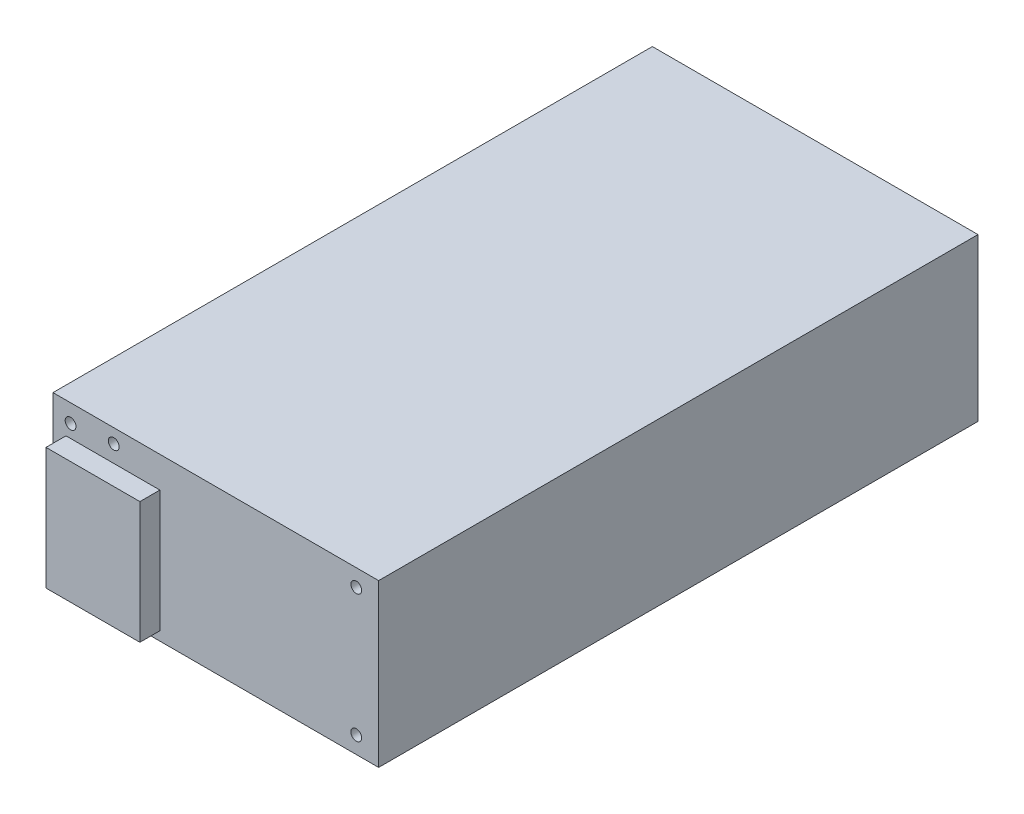
ISO-10303-21;
HEADER;
FILE_DESCRIPTION(('STEP AP214'),'2;1');
FILE_NAME('part.step','',(''),(''),'','','');
FILE_SCHEMA(('AUTOMOTIVE_DESIGN { 1 0 10303 214 1 1 1 1 }'));
ENDSEC;
DATA;
#1=APPLICATION_CONTEXT('core data for automotive mechanical design processes');
#2=APPLICATION_PROTOCOL_DEFINITION('international standard','automotive_design',2000,#1);
#3=PRODUCT_CONTEXT('',#1,'mechanical');
#4=PRODUCT('Part','Part','',(#3));
#5=PRODUCT_RELATED_PRODUCT_CATEGORY('part','',(#4));
#6=PRODUCT_DEFINITION_FORMATION('','',#4);
#7=PRODUCT_DEFINITION_CONTEXT('part definition',#1,'design');
#8=PRODUCT_DEFINITION('design','',#6,#7);
#9=PRODUCT_DEFINITION_SHAPE('','',#8);
#10=(LENGTH_UNIT() NAMED_UNIT(*) SI_UNIT(.MILLI.,.METRE.));
#11=(NAMED_UNIT(*) PLANE_ANGLE_UNIT() SI_UNIT($,.RADIAN.));
#12=(NAMED_UNIT(*) SI_UNIT($,.STERADIAN.) SOLID_ANGLE_UNIT());
#13=UNCERTAINTY_MEASURE_WITH_UNIT(LENGTH_MEASURE(1.E-05),#10,'distance_accuracy_value','');
#14=(GEOMETRIC_REPRESENTATION_CONTEXT(3) GLOBAL_UNCERTAINTY_ASSIGNED_CONTEXT((#13)) GLOBAL_UNIT_ASSIGNED_CONTEXT((#10,
#11,#12)) REPRESENTATION_CONTEXT('',''));
#15=CARTESIAN_POINT('',(0.,0.,0.));
#16=DIRECTION('',(0.,0.,1.));
#17=DIRECTION('',(1.,0.,0.));
#18=AXIS2_PLACEMENT_3D('',#15,#16,#17);
#19=CARTESIAN_POINT('',(81.5,0.,0.));
#20=DIRECTION('',(0.,0.,-1.));
#21=DIRECTION('',(-1.,0.,0.));
#22=AXIS2_PLACEMENT_3D('',#19,#20,#21);
#23=PLANE('',#22);
#24=DIRECTION('',(0.,-1.,0.));
#25=VECTOR('',#24,1.);
#26=CARTESIAN_POINT('',(0.,0.,0.));
#27=LINE('',#26,#25);
#28=CARTESIAN_POINT('',(0.,40.5,0.));
#29=VERTEX_POINT('',#28);
#30=CARTESIAN_POINT('',(0.,0.,0.));
#31=VERTEX_POINT('',#30);
#32=EDGE_CURVE('E171',#29,#31,#27,.T.);
#33=ORIENTED_EDGE('',*,*,#32,.T.);
#34=DIRECTION('',(-1.,0.,0.));
#35=VECTOR('',#34,1.);
#36=CARTESIAN_POINT('',(81.5,0.,0.));
#37=LINE('',#36,#35);
#38=CARTESIAN_POINT('',(81.5,0.,0.));
#39=VERTEX_POINT('',#38);
#40=EDGE_CURVE('E177',#39,#31,#37,.T.);
#41=ORIENTED_EDGE('',*,*,#40,.F.);
#42=DIRECTION('',(0.,-1.,0.));
#43=VECTOR('',#42,1.);
#44=CARTESIAN_POINT('',(81.5,0.,0.));
#45=LINE('',#44,#43);
#46=CARTESIAN_POINT('',(81.5,40.5,0.));
#47=VERTEX_POINT('',#46);
#48=EDGE_CURVE('E175',#47,#39,#45,.T.);
#49=ORIENTED_EDGE('',*,*,#48,.F.);
#50=DIRECTION('',(-1.,0.,0.));
#51=VECTOR('',#50,1.);
#52=CARTESIAN_POINT('',(81.5,40.5,0.));
#53=LINE('',#52,#51);
#54=EDGE_CURVE('E187',#47,#29,#53,.T.);
#55=ORIENTED_EDGE('',*,*,#54,.T.);
#56=EDGE_LOOP('',(#33,#41,#49,#55));
#57=FACE_BOUND('',#56,.T.);
#58=CARTESIAN_POINT('',(75.9,4.25,0.));
#59=DIRECTION('',(0.,0.,1.));
#60=DIRECTION('',(1.,0.,0.));
#61=AXIS2_PLACEMENT_3D('',#58,#59,#60);
#62=CIRCLE('',#61,1.35254999999999);
#63=CARTESIAN_POINT('',(77.25255,4.25,0.));
#64=VERTEX_POINT('',#63);
#65=EDGE_CURVE('E160',#64,#64,#62,.T.);
#66=ORIENTED_EDGE('',*,*,#65,.F.);
#67=EDGE_LOOP('',(#66));
#68=FACE_BOUND('',#67,.T.);
#69=CARTESIAN_POINT('',(75.9,36.25,0.));
#70=DIRECTION('',(0.,0.,1.));
#71=DIRECTION('',(1.,0.,0.));
#72=AXIS2_PLACEMENT_3D('',#69,#70,#71);
#73=CIRCLE('',#72,1.35254999999999);
#74=CARTESIAN_POINT('',(77.25255,36.25,0.));
#75=VERTEX_POINT('',#74);
#76=EDGE_CURVE('E154',#75,#75,#73,.T.);
#77=ORIENTED_EDGE('',*,*,#76,.F.);
#78=EDGE_LOOP('',(#77));
#79=FACE_BOUND('',#78,.T.);
#80=CARTESIAN_POINT('',(15.2,37.,0.));
#81=DIRECTION('',(0.,0.,1.));
#82=DIRECTION('',(1.,0.,0.));
#83=AXIS2_PLACEMENT_3D('',#80,#81,#82);
#84=CIRCLE('',#83,1.35254999999999);
#85=CARTESIAN_POINT('',(16.55255,37.,0.));
#86=VERTEX_POINT('',#85);
#87=EDGE_CURVE('E148',#86,#86,#84,.T.);
#88=ORIENTED_EDGE('',*,*,#87,.F.);
#89=EDGE_LOOP('',(#88));
#90=FACE_BOUND('',#89,.T.);
#91=CARTESIAN_POINT('',(4.4,36.,0.));
#92=DIRECTION('',(0.,0.,1.));
#93=DIRECTION('',(1.,0.,0.));
#94=AXIS2_PLACEMENT_3D('',#91,#92,#93);
#95=CIRCLE('',#94,1.35254999999999);
#96=CARTESIAN_POINT('',(5.75254999999999,36.,0.));
#97=VERTEX_POINT('',#96);
#98=EDGE_CURVE('E137',#97,#97,#95,.T.);
#99=ORIENTED_EDGE('',*,*,#98,.F.);
#100=EDGE_LOOP('',(#99));
#101=FACE_BOUND('',#100,.T.);
#102=DIRECTION('',(0.,-1.,0.));
#103=VECTOR('',#102,1.);
#104=CARTESIAN_POINT('',(3.25,2.25,0.));
#105=LINE('',#104,#103);
#106=CARTESIAN_POINT('',(3.25,32.75,0.));
#107=VERTEX_POINT('',#106);
#108=CARTESIAN_POINT('',(3.25,2.25,0.));
#109=VERTEX_POINT('',#108);
#110=EDGE_CURVE('E136',#107,#109,#105,.T.);
#111=ORIENTED_EDGE('',*,*,#110,.F.);
#112=DIRECTION('',(-1.,0.,0.));
#113=VECTOR('',#112,1.);
#114=CARTESIAN_POINT('',(3.25,32.75,0.));
#115=LINE('',#114,#113);
#116=CARTESIAN_POINT('',(26.75,32.75,0.));
#117=VERTEX_POINT('',#116);
#118=EDGE_CURVE('E133',#117,#107,#115,.T.);
#119=ORIENTED_EDGE('',*,*,#118,.F.);
#120=DIRECTION('',(0.,1.,0.));
#121=VECTOR('',#120,1.);
#122=CARTESIAN_POINT('',(26.75,2.25000000000001,0.));
#123=LINE('',#122,#121);
#124=CARTESIAN_POINT('',(26.75,2.25000000000001,0.));
#125=VERTEX_POINT('',#124);
#126=EDGE_CURVE('E59',#125,#117,#123,.T.);
#127=ORIENTED_EDGE('',*,*,#126,.F.);
#128=DIRECTION('',(1.,0.,0.));
#129=VECTOR('',#128,1.);
#130=CARTESIAN_POINT('',(3.25,2.25,0.));
#131=LINE('',#130,#129);
#132=EDGE_CURVE('E54',#109,#125,#131,.T.);
#133=ORIENTED_EDGE('',*,*,#132,.F.);
#134=EDGE_LOOP('',(#111,#119,#127,#133));
#135=FACE_BOUND('',#134,.T.);
#136=ADVANCED_FACE('F39',(#57,#68,#79,#90,#101,#135),#23,.F.);
#137=CARTESIAN_POINT('',(81.5,0.,-150.));
#138=DIRECTION('',(0.,1.,0.));
#139=DIRECTION('',(0.,0.,1.));
#140=AXIS2_PLACEMENT_3D('',#137,#138,#139);
#141=PLANE('',#140);
#142=DIRECTION('',(0.,0.,-1.));
#143=VECTOR('',#142,1.);
#144=CARTESIAN_POINT('',(0.,0.,-150.));
#145=LINE('',#144,#143);
#146=CARTESIAN_POINT('',(0.,0.,-150.));
#147=VERTEX_POINT('',#146);
#148=EDGE_CURVE('E166',#31,#147,#145,.T.);
#149=ORIENTED_EDGE('',*,*,#148,.T.);
#150=DIRECTION('',(-1.,0.,0.));
#151=VECTOR('',#150,1.);
#152=CARTESIAN_POINT('',(81.5,0.,-150.));
#153=LINE('',#152,#151);
#154=CARTESIAN_POINT('',(81.5,0.,-150.));
#155=VERTEX_POINT('',#154);
#156=EDGE_CURVE('E11',#155,#147,#153,.T.);
#157=ORIENTED_EDGE('',*,*,#156,.F.);
#158=DIRECTION('',(0.,0.,-1.));
#159=VECTOR('',#158,1.);
#160=CARTESIAN_POINT('',(81.5,0.,-150.));
#161=LINE('',#160,#159);
#162=EDGE_CURVE('E167',#39,#155,#161,.T.);
#163=ORIENTED_EDGE('',*,*,#162,.F.);
#164=ORIENTED_EDGE('',*,*,#40,.T.);
#165=EDGE_LOOP('',(#149,#157,#163,#164));
#166=FACE_BOUND('',#165,.T.);
#167=ADVANCED_FACE('F41',(#166),#141,.F.);
#168=CARTESIAN_POINT('',(81.5,40.5,-150.));
#169=DIRECTION('',(0.,0.,1.));
#170=DIRECTION('',(1.,0.,0.));
#171=AXIS2_PLACEMENT_3D('',#168,#169,#170);
#172=PLANE('',#171);
#173=DIRECTION('',(0.,1.,0.));
#174=VECTOR('',#173,1.);
#175=CARTESIAN_POINT('',(0.,40.5,-150.));
#176=LINE('',#175,#174);
#177=CARTESIAN_POINT('',(0.,40.5,-150.));
#178=VERTEX_POINT('',#177);
#179=EDGE_CURVE('E180',#147,#178,#176,.T.);
#180=ORIENTED_EDGE('',*,*,#179,.T.);
#181=DIRECTION('',(-1.,0.,0.));
#182=VECTOR('',#181,1.);
#183=CARTESIAN_POINT('',(81.5,40.5,-150.));
#184=LINE('',#183,#182);
#185=CARTESIAN_POINT('',(81.5,40.5,-150.));
#186=VERTEX_POINT('',#185);
#187=EDGE_CURVE('E47',#186,#178,#184,.T.);
#188=ORIENTED_EDGE('',*,*,#187,.F.);
#189=DIRECTION('',(0.,1.,0.));
#190=VECTOR('',#189,1.);
#191=CARTESIAN_POINT('',(81.5,40.5,-150.));
#192=LINE('',#191,#190);
#193=EDGE_CURVE('E170',#155,#186,#192,.T.);
#194=ORIENTED_EDGE('',*,*,#193,.F.);
#195=ORIENTED_EDGE('',*,*,#156,.T.);
#196=EDGE_LOOP('',(#180,#188,#194,#195));
#197=FACE_BOUND('',#196,.T.);
#198=ADVANCED_FACE('F210',(#197),#172,.F.);
#199=CARTESIAN_POINT('',(81.5,40.5,0.));
#200=DIRECTION('',(0.,-1.,0.));
#201=DIRECTION('',(0.,0.,-1.));
#202=AXIS2_PLACEMENT_3D('',#199,#200,#201);
#203=PLANE('',#202);
#204=DIRECTION('',(0.,0.,1.));
#205=VECTOR('',#204,1.);
#206=CARTESIAN_POINT('',(0.,40.5,0.));
#207=LINE('',#206,#205);
#208=EDGE_CURVE('E182',#178,#29,#207,.T.);
#209=ORIENTED_EDGE('',*,*,#208,.T.);
#210=ORIENTED_EDGE('',*,*,#54,.F.);
#211=DIRECTION('',(0.,0.,1.));
#212=VECTOR('',#211,1.);
#213=CARTESIAN_POINT('',(81.5,40.5,0.));
#214=LINE('',#213,#212);
#215=EDGE_CURVE('E173',#186,#47,#214,.T.);
#216=ORIENTED_EDGE('',*,*,#215,.F.);
#217=ORIENTED_EDGE('',*,*,#187,.T.);
#218=EDGE_LOOP('',(#209,#210,#216,#217));
#219=FACE_BOUND('',#218,.T.);
#220=ADVANCED_FACE('F194',(#219),#203,.F.);
#221=CARTESIAN_POINT('',(81.5,0.,0.));
#222=DIRECTION('',(-1.,0.,0.));
#223=DIRECTION('',(0.,0.,1.));
#224=AXIS2_PLACEMENT_3D('',#221,#222,#223);
#225=PLANE('',#224);
#226=ORIENTED_EDGE('',*,*,#162,.T.);
#227=ORIENTED_EDGE('',*,*,#193,.T.);
#228=ORIENTED_EDGE('',*,*,#215,.T.);
#229=ORIENTED_EDGE('',*,*,#48,.T.);
#230=EDGE_LOOP('',(#226,#227,#228,#229));
#231=FACE_BOUND('',#230,.T.);
#232=ADVANCED_FACE('F209',(#231),#225,.F.);
#233=CARTESIAN_POINT('',(0.,0.,0.));
#234=DIRECTION('',(-1.,0.,0.));
#235=DIRECTION('',(0.,0.,1.));
#236=AXIS2_PLACEMENT_3D('',#233,#234,#235);
#237=PLANE('',#236);
#238=ORIENTED_EDGE('',*,*,#148,.F.);
#239=ORIENTED_EDGE('',*,*,#32,.F.);
#240=ORIENTED_EDGE('',*,*,#208,.F.);
#241=ORIENTED_EDGE('',*,*,#179,.F.);
#242=EDGE_LOOP('',(#238,#239,#240,#241));
#243=FACE_BOUND('',#242,.T.);
#244=ADVANCED_FACE('F200',(#243),#237,.T.);
#245=CARTESIAN_POINT('',(75.9,4.25,-5.));
#246=DIRECTION('',(0.,0.,1.));
#247=DIRECTION('',(1.,0.,0.));
#248=AXIS2_PLACEMENT_3D('',#245,#246,#247);
#249=CONICAL_SURFACE('',#248,1.35254999999999,1.02974425867665);
#250=CARTESIAN_POINT('',(75.9,4.25,-5.81269403026573));
#251=VERTEX_POINT('',#250);
#252=VERTEX_LOOP('',#251);
#253=FACE_BOUND('',#252,.T.);
#254=CARTESIAN_POINT('',(75.9,4.25,-5.));
#255=DIRECTION('',(0.,0.,1.));
#256=DIRECTION('',(1.,0.,0.));
#257=AXIS2_PLACEMENT_3D('',#254,#255,#256);
#258=CIRCLE('',#257,1.35254999999999);
#259=CARTESIAN_POINT('',(77.25255,4.25,-5.));
#260=VERTEX_POINT('',#259);
#261=EDGE_CURVE('E163',#260,#260,#258,.T.);
#262=ORIENTED_EDGE('',*,*,#261,.T.);
#263=EDGE_LOOP('',(#262));
#264=FACE_BOUND('',#263,.T.);
#265=ADVANCED_FACE('F224',(#253,#264),#249,.F.);
#266=CARTESIAN_POINT('',(75.9,4.25,0.));
#267=DIRECTION('',(0.,0.,1.));
#268=DIRECTION('',(1.,0.,0.));
#269=AXIS2_PLACEMENT_3D('',#266,#267,#268);
#270=CYLINDRICAL_SURFACE('',#269,1.35254999999999);
#271=ORIENTED_EDGE('',*,*,#261,.F.);
#272=EDGE_LOOP('',(#271));
#273=FACE_BOUND('',#272,.T.);
#274=ORIENTED_EDGE('',*,*,#65,.T.);
#275=EDGE_LOOP('',(#274));
#276=FACE_BOUND('',#275,.T.);
#277=ADVANCED_FACE('F229',(#273,#276),#270,.F.);
#278=CARTESIAN_POINT('',(75.9,36.25,-5.));
#279=DIRECTION('',(0.,0.,1.));
#280=DIRECTION('',(1.,0.,0.));
#281=AXIS2_PLACEMENT_3D('',#278,#279,#280);
#282=CONICAL_SURFACE('',#281,1.35254999999999,1.02974425867665);
#283=CARTESIAN_POINT('',(75.9,36.25,-5.81269403026573));
#284=VERTEX_POINT('',#283);
#285=VERTEX_LOOP('',#284);
#286=FACE_BOUND('',#285,.T.);
#287=CARTESIAN_POINT('',(75.9,36.25,-5.));
#288=DIRECTION('',(0.,0.,1.));
#289=DIRECTION('',(1.,0.,0.));
#290=AXIS2_PLACEMENT_3D('',#287,#288,#289);
#291=CIRCLE('',#290,1.35254999999999);
#292=CARTESIAN_POINT('',(77.25255,36.25,-5.));
#293=VERTEX_POINT('',#292);
#294=EDGE_CURVE('E157',#293,#293,#291,.T.);
#295=ORIENTED_EDGE('',*,*,#294,.T.);
#296=EDGE_LOOP('',(#295));
#297=FACE_BOUND('',#296,.T.);
#298=ADVANCED_FACE('F233',(#286,#297),#282,.F.);
#299=CARTESIAN_POINT('',(75.9,36.25,0.));
#300=DIRECTION('',(0.,0.,1.));
#301=DIRECTION('',(1.,0.,0.));
#302=AXIS2_PLACEMENT_3D('',#299,#300,#301);
#303=CYLINDRICAL_SURFACE('',#302,1.35254999999999);
#304=ORIENTED_EDGE('',*,*,#294,.F.);
#305=EDGE_LOOP('',(#304));
#306=FACE_BOUND('',#305,.T.);
#307=ORIENTED_EDGE('',*,*,#76,.T.);
#308=EDGE_LOOP('',(#307));
#309=FACE_BOUND('',#308,.T.);
#310=ADVANCED_FACE('F237',(#306,#309),#303,.F.);
#311=CARTESIAN_POINT('',(15.2,37.,-5.));
#312=DIRECTION('',(0.,0.,1.));
#313=DIRECTION('',(1.,0.,0.));
#314=AXIS2_PLACEMENT_3D('',#311,#312,#313);
#315=CONICAL_SURFACE('',#314,1.35254999999999,1.02974425867665);
#316=CARTESIAN_POINT('',(15.2,37.,-5.81269403026573));
#317=VERTEX_POINT('',#316);
#318=VERTEX_LOOP('',#317);
#319=FACE_BOUND('',#318,.T.);
#320=CARTESIAN_POINT('',(15.2,37.,-5.));
#321=DIRECTION('',(0.,0.,1.));
#322=DIRECTION('',(1.,0.,0.));
#323=AXIS2_PLACEMENT_3D('',#320,#321,#322);
#324=CIRCLE('',#323,1.35254999999999);
#325=CARTESIAN_POINT('',(16.55255,37.,-5.));
#326=VERTEX_POINT('',#325);
#327=EDGE_CURVE('E151',#326,#326,#324,.T.);
#328=ORIENTED_EDGE('',*,*,#327,.T.);
#329=EDGE_LOOP('',(#328));
#330=FACE_BOUND('',#329,.T.);
#331=ADVANCED_FACE('F241',(#319,#330),#315,.F.);
#332=CARTESIAN_POINT('',(15.2,37.,0.));
#333=DIRECTION('',(0.,0.,1.));
#334=DIRECTION('',(1.,0.,0.));
#335=AXIS2_PLACEMENT_3D('',#332,#333,#334);
#336=CYLINDRICAL_SURFACE('',#335,1.35254999999999);
#337=ORIENTED_EDGE('',*,*,#327,.F.);
#338=EDGE_LOOP('',(#337));
#339=FACE_BOUND('',#338,.T.);
#340=ORIENTED_EDGE('',*,*,#87,.T.);
#341=EDGE_LOOP('',(#340));
#342=FACE_BOUND('',#341,.T.);
#343=ADVANCED_FACE('F245',(#339,#342),#336,.F.);
#344=CARTESIAN_POINT('',(4.4,36.,-5.));
#345=DIRECTION('',(0.,0.,1.));
#346=DIRECTION('',(1.,0.,0.));
#347=AXIS2_PLACEMENT_3D('',#344,#345,#346);
#348=CONICAL_SURFACE('',#347,1.35254999999999,1.02974425867665);
#349=CARTESIAN_POINT('',(4.4,36.,-5.81269403026573));
#350=VERTEX_POINT('',#349);
#351=VERTEX_LOOP('',#350);
#352=FACE_BOUND('',#351,.T.);
#353=CARTESIAN_POINT('',(4.4,36.,-5.));
#354=DIRECTION('',(0.,0.,1.));
#355=DIRECTION('',(1.,0.,0.));
#356=AXIS2_PLACEMENT_3D('',#353,#354,#355);
#357=CIRCLE('',#356,1.35254999999999);
#358=CARTESIAN_POINT('',(5.75254999999999,36.,-5.));
#359=VERTEX_POINT('',#358);
#360=EDGE_CURVE('E140',#359,#359,#357,.T.);
#361=ORIENTED_EDGE('',*,*,#360,.T.);
#362=EDGE_LOOP('',(#361));
#363=FACE_BOUND('',#362,.T.);
#364=ADVANCED_FACE('F249',(#352,#363),#348,.F.);
#365=CARTESIAN_POINT('',(4.4,36.,0.));
#366=DIRECTION('',(0.,0.,1.));
#367=DIRECTION('',(1.,0.,0.));
#368=AXIS2_PLACEMENT_3D('',#365,#366,#367);
#369=CYLINDRICAL_SURFACE('',#368,1.35254999999999);
#370=ORIENTED_EDGE('',*,*,#360,.F.);
#371=EDGE_LOOP('',(#370));
#372=FACE_BOUND('',#371,.T.);
#373=ORIENTED_EDGE('',*,*,#98,.T.);
#374=EDGE_LOOP('',(#373));
#375=FACE_BOUND('',#374,.T.);
#376=ADVANCED_FACE('F253',(#372,#375),#369,.F.);
#377=CARTESIAN_POINT('',(3.25,2.25,5.));
#378=DIRECTION('',(1.,0.,0.));
#379=DIRECTION('',(0.,1.,0.));
#380=AXIS2_PLACEMENT_3D('',#377,#378,#379);
#381=PLANE('',#380);
#382=ORIENTED_EDGE('',*,*,#110,.T.);
#383=DIRECTION('',(0.,0.,-1.));
#384=VECTOR('',#383,1.);
#385=CARTESIAN_POINT('',(3.25,2.25,5.));
#386=LINE('',#385,#384);
#387=CARTESIAN_POINT('',(3.25,2.25,5.));
#388=VERTEX_POINT('',#387);
#389=EDGE_CURVE('E117',#388,#109,#386,.T.);
#390=ORIENTED_EDGE('',*,*,#389,.F.);
#391=DIRECTION('',(0.,-1.,0.));
#392=VECTOR('',#391,1.);
#393=CARTESIAN_POINT('',(3.25,2.25,5.));
#394=LINE('',#393,#392);
#395=CARTESIAN_POINT('',(3.25,32.75,5.));
#396=VERTEX_POINT('',#395);
#397=EDGE_CURVE('E124',#396,#388,#394,.T.);
#398=ORIENTED_EDGE('',*,*,#397,.F.);
#399=DIRECTION('',(0.,0.,-1.));
#400=VECTOR('',#399,1.);
#401=CARTESIAN_POINT('',(3.25,32.75,5.));
#402=LINE('',#401,#400);
#403=EDGE_CURVE('E429',#396,#107,#402,.T.);
#404=ORIENTED_EDGE('',*,*,#403,.T.);
#405=EDGE_LOOP('',(#382,#390,#398,#404));
#406=FACE_BOUND('',#405,.T.);
#407=ADVANCED_FACE('F135',(#406),#381,.F.);
#408=CARTESIAN_POINT('',(3.25,2.25,5.));
#409=DIRECTION('',(0.,1.,0.));
#410=DIRECTION('',(-1.,0.,0.));
#411=AXIS2_PLACEMENT_3D('',#408,#409,#410);
#412=PLANE('',#411);
#413=ORIENTED_EDGE('',*,*,#132,.T.);
#414=DIRECTION('',(0.,0.,-1.));
#415=VECTOR('',#414,1.);
#416=CARTESIAN_POINT('',(26.75,2.25000000000001,5.));
#417=LINE('',#416,#415);
#418=CARTESIAN_POINT('',(26.75,2.25000000000001,5.));
#419=VERTEX_POINT('',#418);
#420=EDGE_CURVE('E120',#419,#125,#417,.T.);
#421=ORIENTED_EDGE('',*,*,#420,.F.);
#422=DIRECTION('',(1.,0.,0.));
#423=VECTOR('',#422,1.);
#424=CARTESIAN_POINT('',(3.25,2.25,5.));
#425=LINE('',#424,#423);
#426=EDGE_CURVE('E113',#388,#419,#425,.T.);
#427=ORIENTED_EDGE('',*,*,#426,.F.);
#428=ORIENTED_EDGE('',*,*,#389,.T.);
#429=EDGE_LOOP('',(#413,#421,#427,#428));
#430=FACE_BOUND('',#429,.T.);
#431=ADVANCED_FACE('F115',(#430),#412,.F.);
#432=CARTESIAN_POINT('',(26.75,2.25000000000001,5.));
#433=DIRECTION('',(-1.,0.,0.));
#434=DIRECTION('',(0.,-1.,0.));
#435=AXIS2_PLACEMENT_3D('',#432,#433,#434);
#436=PLANE('',#435);
#437=ORIENTED_EDGE('',*,*,#126,.T.);
#438=DIRECTION('',(0.,0.,-1.));
#439=VECTOR('',#438,1.);
#440=CARTESIAN_POINT('',(26.75,32.75,5.));
#441=LINE('',#440,#439);
#442=CARTESIAN_POINT('',(26.75,32.75,5.));
#443=VERTEX_POINT('',#442);
#444=EDGE_CURVE('E142',#443,#117,#441,.T.);
#445=ORIENTED_EDGE('',*,*,#444,.F.);
#446=DIRECTION('',(0.,1.,0.));
#447=VECTOR('',#446,1.);
#448=CARTESIAN_POINT('',(26.75,2.25000000000001,5.));
#449=LINE('',#448,#447);
#450=EDGE_CURVE('E123',#419,#443,#449,.T.);
#451=ORIENTED_EDGE('',*,*,#450,.F.);
#452=ORIENTED_EDGE('',*,*,#420,.T.);
#453=EDGE_LOOP('',(#437,#445,#451,#452));
#454=FACE_BOUND('',#453,.T.);
#455=ADVANCED_FACE('F262',(#454),#436,.F.);
#456=CARTESIAN_POINT('',(3.25,32.75,5.));
#457=DIRECTION('',(0.,-1.,0.));
#458=DIRECTION('',(0.,0.,-1.));
#459=AXIS2_PLACEMENT_3D('',#456,#457,#458);
#460=PLANE('',#459);
#461=ORIENTED_EDGE('',*,*,#118,.T.);
#462=ORIENTED_EDGE('',*,*,#403,.F.);
#463=DIRECTION('',(-1.,0.,0.));
#464=VECTOR('',#463,1.);
#465=CARTESIAN_POINT('',(3.25,32.75,5.));
#466=LINE('',#465,#464);
#467=EDGE_CURVE('E129',#443,#396,#466,.T.);
#468=ORIENTED_EDGE('',*,*,#467,.F.);
#469=ORIENTED_EDGE('',*,*,#444,.T.);
#470=EDGE_LOOP('',(#461,#462,#468,#469));
#471=FACE_BOUND('',#470,.T.);
#472=ADVANCED_FACE('F265',(#471),#460,.F.);
#473=CARTESIAN_POINT('',(0.,0.,5.));
#474=DIRECTION('',(0.,0.,-1.));
#475=DIRECTION('',(-1.,0.,0.));
#476=AXIS2_PLACEMENT_3D('',#473,#474,#475);
#477=PLANE('',#476);
#478=ORIENTED_EDGE('',*,*,#397,.T.);
#479=ORIENTED_EDGE('',*,*,#426,.T.);
#480=ORIENTED_EDGE('',*,*,#450,.T.);
#481=ORIENTED_EDGE('',*,*,#467,.T.);
#482=EDGE_LOOP('',(#478,#479,#480,#481));
#483=FACE_BOUND('',#482,.T.);
#484=ADVANCED_FACE('F127',(#483),#477,.F.);
#485=CLOSED_SHELL('',(#136,#167,#198,#220,#232,#244,#265,#277,#298,#310,#331,#343,#364,#376,
#407,#431,#455,#472,#484));
#486=MANIFOLD_SOLID_BREP('B2',#485);
#487=ADVANCED_BREP_SHAPE_REPRESENTATION('',(#18,#486),#14);
#488=SHAPE_DEFINITION_REPRESENTATION(#9,#487);
ENDSEC;
END-ISO-10303-21;
